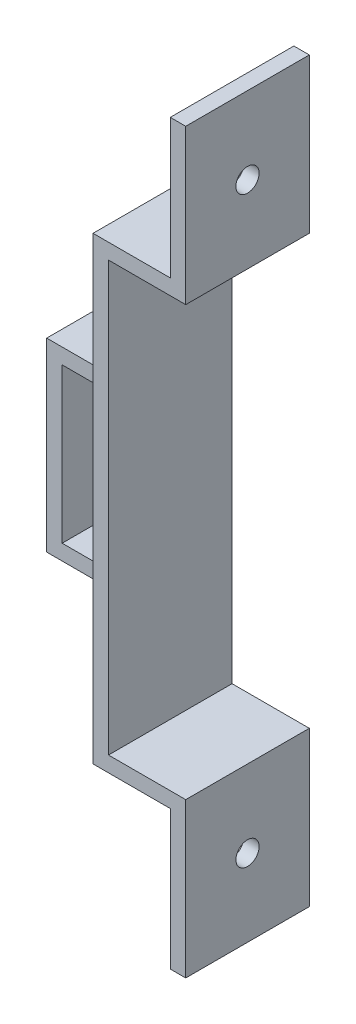
ISO-10303-21;
HEADER;
FILE_DESCRIPTION(('STEP AP214'),'2;1');
FILE_NAME('part.step','',(''),(''),'','','');
FILE_SCHEMA(('AUTOMOTIVE_DESIGN { 1 0 10303 214 1 1 1 1 }'));
ENDSEC;
DATA;
#1=APPLICATION_CONTEXT('core data for automotive mechanical design processes');
#2=APPLICATION_PROTOCOL_DEFINITION('international standard','automotive_design',2000,#1);
#3=PRODUCT_CONTEXT('',#1,'mechanical');
#4=PRODUCT('Part','Part','',(#3));
#5=PRODUCT_RELATED_PRODUCT_CATEGORY('part','',(#4));
#6=PRODUCT_DEFINITION_FORMATION('','',#4);
#7=PRODUCT_DEFINITION_CONTEXT('part definition',#1,'design');
#8=PRODUCT_DEFINITION('design','',#6,#7);
#9=PRODUCT_DEFINITION_SHAPE('','',#8);
#10=(LENGTH_UNIT() NAMED_UNIT(*) SI_UNIT(.MILLI.,.METRE.));
#11=(NAMED_UNIT(*) PLANE_ANGLE_UNIT() SI_UNIT($,.RADIAN.));
#12=(NAMED_UNIT(*) SI_UNIT($,.STERADIAN.) SOLID_ANGLE_UNIT());
#13=UNCERTAINTY_MEASURE_WITH_UNIT(LENGTH_MEASURE(1.E-05),#10,'distance_accuracy_value','');
#14=(GEOMETRIC_REPRESENTATION_CONTEXT(3) GLOBAL_UNCERTAINTY_ASSIGNED_CONTEXT((#13)) GLOBAL_UNIT_ASSIGNED_CONTEXT((#10,
#11,#12)) REPRESENTATION_CONTEXT('',''));
#15=CARTESIAN_POINT('',(0.,0.,0.));
#16=DIRECTION('',(0.,0.,1.));
#17=DIRECTION('',(1.,0.,0.));
#18=AXIS2_PLACEMENT_3D('',#15,#16,#17);
#19=CARTESIAN_POINT('',(-25.,0.,8.));
#20=DIRECTION('',(1.,0.,0.));
#21=DIRECTION('',(0.,1.,0.));
#22=AXIS2_PLACEMENT_3D('',#19,#20,#21);
#23=PLANE('',#22);
#24=DIRECTION('',(0.,1.,0.));
#25=VECTOR('',#24,1.);
#26=CARTESIAN_POINT('',(-25.,12.,5.));
#27=LINE('',#26,#25);
#28=CARTESIAN_POINT('',(-25.,10.,5.));
#29=VERTEX_POINT('',#28);
#30=CARTESIAN_POINT('',(-25.,12.,5.));
#31=VERTEX_POINT('',#30);
#32=EDGE_CURVE('E179',#29,#31,#27,.T.);
#33=ORIENTED_EDGE('',*,*,#32,.F.);
#34=DIRECTION('',(0.,0.,-1.));
#35=VECTOR('',#34,1.);
#36=CARTESIAN_POINT('',(-25.,10.,5.));
#37=LINE('',#36,#35);
#38=CARTESIAN_POINT('',(-25.,10.,-5.));
#39=VERTEX_POINT('',#38);
#40=EDGE_CURVE('E578',#29,#39,#37,.T.);
#41=ORIENTED_EDGE('',*,*,#40,.T.);
#42=DIRECTION('',(0.,1.,0.));
#43=VECTOR('',#42,1.);
#44=CARTESIAN_POINT('',(-25.,12.,-5.));
#45=LINE('',#44,#43);
#46=CARTESIAN_POINT('',(-25.,12.,-5.));
#47=VERTEX_POINT('',#46);
#48=EDGE_CURVE('E193',#39,#47,#45,.T.);
#49=ORIENTED_EDGE('',*,*,#48,.T.);
#50=DIRECTION('',(0.,0.,-1.));
#51=VECTOR('',#50,1.);
#52=CARTESIAN_POINT('',(-25.,12.,5.));
#53=LINE('',#52,#51);
#54=EDGE_CURVE('E58',#31,#47,#53,.T.);
#55=ORIENTED_EDGE('',*,*,#54,.F.);
#56=EDGE_LOOP('',(#33,#41,#49,#55));
#57=FACE_BOUND('',#56,.T.);
#58=DIRECTION('',(0.,-1.,0.));
#59=VECTOR('',#58,1.);
#60=CARTESIAN_POINT('',(-25.,0.,-8.));
#61=LINE('',#60,#59);
#62=CARTESIAN_POINT('',(-25.,29.75,-8.));
#63=VERTEX_POINT('',#62);
#64=CARTESIAN_POINT('',(-25.,-29.75,-8.));
#65=VERTEX_POINT('',#64);
#66=EDGE_CURVE('E270',#63,#65,#61,.T.);
#67=ORIENTED_EDGE('',*,*,#66,.T.);
#68=DIRECTION('',(0.,0.,-1.));
#69=VECTOR('',#68,1.);
#70=CARTESIAN_POINT('',(-25.,-29.75,8.));
#71=LINE('',#70,#69);
#72=CARTESIAN_POINT('',(-25.,-29.75,8.));
#73=VERTEX_POINT('',#72);
#74=EDGE_CURVE('E280',#73,#65,#71,.T.);
#75=ORIENTED_EDGE('',*,*,#74,.F.);
#76=DIRECTION('',(0.,-1.,0.));
#77=VECTOR('',#76,1.);
#78=CARTESIAN_POINT('',(-25.,0.,8.));
#79=LINE('',#78,#77);
#80=CARTESIAN_POINT('',(-25.,29.75,8.));
#81=VERTEX_POINT('',#80);
#82=EDGE_CURVE('E237',#81,#73,#79,.T.);
#83=ORIENTED_EDGE('',*,*,#82,.F.);
#84=DIRECTION('',(0.,0.,-1.));
#85=VECTOR('',#84,1.);
#86=CARTESIAN_POINT('',(-25.,29.75,8.));
#87=LINE('',#86,#85);
#88=EDGE_CURVE('E283',#81,#63,#87,.T.);
#89=ORIENTED_EDGE('',*,*,#88,.T.);
#90=EDGE_LOOP('',(#67,#75,#83,#89));
#91=FACE_BOUND('',#90,.T.);
#92=DIRECTION('',(0.,1.,0.));
#93=VECTOR('',#92,1.);
#94=CARTESIAN_POINT('',(-25.,-10.,5.));
#95=LINE('',#94,#93);
#96=CARTESIAN_POINT('',(-25.,-12.,5.));
#97=VERTEX_POINT('',#96);
#98=CARTESIAN_POINT('',(-25.,-10.,5.));
#99=VERTEX_POINT('',#98);
#100=EDGE_CURVE('E616',#97,#99,#95,.T.);
#101=ORIENTED_EDGE('',*,*,#100,.F.);
#102=DIRECTION('',(0.,0.,-1.));
#103=VECTOR('',#102,1.);
#104=CARTESIAN_POINT('',(-25.,-12.,5.));
#105=LINE('',#104,#103);
#106=CARTESIAN_POINT('',(-25.,-12.,-5.));
#107=VERTEX_POINT('',#106);
#108=EDGE_CURVE('E593',#97,#107,#105,.T.);
#109=ORIENTED_EDGE('',*,*,#108,.T.);
#110=DIRECTION('',(0.,1.,0.));
#111=VECTOR('',#110,1.);
#112=CARTESIAN_POINT('',(-25.,-10.,-5.));
#113=LINE('',#112,#111);
#114=CARTESIAN_POINT('',(-25.,-10.,-5.));
#115=VERTEX_POINT('',#114);
#116=EDGE_CURVE('E604',#107,#115,#113,.T.);
#117=ORIENTED_EDGE('',*,*,#116,.T.);
#118=DIRECTION('',(0.,0.,-1.));
#119=VECTOR('',#118,1.);
#120=CARTESIAN_POINT('',(-25.,-10.,5.));
#121=LINE('',#120,#119);
#122=EDGE_CURVE('E591',#99,#115,#121,.T.);
#123=ORIENTED_EDGE('',*,*,#122,.F.);
#124=EDGE_LOOP('',(#101,#109,#117,#123));
#125=FACE_BOUND('',#124,.T.);
#126=ADVANCED_FACE('F35',(#57,#91,#125),#23,.F.);
#127=CARTESIAN_POINT('',(0.,-47.75,8.));
#128=DIRECTION('',(0.,1.,0.));
#129=DIRECTION('',(0.,0.,1.));
#130=AXIS2_PLACEMENT_3D('',#127,#128,#129);
#131=PLANE('',#130);
#132=DIRECTION('',(1.,0.,0.));
#133=VECTOR('',#132,1.);
#134=CARTESIAN_POINT('',(0.,-47.75,-8.));
#135=LINE('',#134,#133);
#136=CARTESIAN_POINT('',(-15.,-47.75,-8.));
#137=VERTEX_POINT('',#136);
#138=CARTESIAN_POINT('',(-13.,-47.75,-8.));
#139=VERTEX_POINT('',#138);
#140=EDGE_CURVE('E211',#137,#139,#135,.T.);
#141=ORIENTED_EDGE('',*,*,#140,.T.);
#142=DIRECTION('',(0.,0.,-1.));
#143=VECTOR('',#142,1.);
#144=CARTESIAN_POINT('',(-13.,-47.75,8.));
#145=LINE('',#144,#143);
#146=CARTESIAN_POINT('',(-13.,-47.75,8.));
#147=VERTEX_POINT('',#146);
#148=EDGE_CURVE('E11',#147,#139,#145,.T.);
#149=ORIENTED_EDGE('',*,*,#148,.F.);
#150=DIRECTION('',(1.,0.,0.));
#151=VECTOR('',#150,1.);
#152=CARTESIAN_POINT('',(0.,-47.75,8.));
#153=LINE('',#152,#151);
#154=CARTESIAN_POINT('',(-15.,-47.75,8.));
#155=VERTEX_POINT('',#154);
#156=EDGE_CURVE('E212',#155,#147,#153,.T.);
#157=ORIENTED_EDGE('',*,*,#156,.F.);
#158=DIRECTION('',(0.,0.,-1.));
#159=VECTOR('',#158,1.);
#160=CARTESIAN_POINT('',(-15.,-47.75,8.));
#161=LINE('',#160,#159);
#162=EDGE_CURVE('E244',#155,#137,#161,.T.);
#163=ORIENTED_EDGE('',*,*,#162,.T.);
#164=EDGE_LOOP('',(#141,#149,#157,#163));
#165=FACE_BOUND('',#164,.T.);
#166=ADVANCED_FACE('F37',(#165),#131,.F.);
#167=CARTESIAN_POINT('',(-13.,0.,8.));
#168=DIRECTION('',(-1.,0.,0.));
#169=DIRECTION('',(0.,0.,1.));
#170=AXIS2_PLACEMENT_3D('',#167,#168,#169);
#171=PLANE('',#170);
#172=CARTESIAN_POINT('',(-13.,-37.75,0.));
#173=DIRECTION('',(-1.,0.,0.));
#174=DIRECTION('',(0.,0.,1.));
#175=AXIS2_PLACEMENT_3D('',#172,#173,#174);
#176=CIRCLE('',#175,1.5);
#177=CARTESIAN_POINT('',(-13.,-37.75,1.5));
#178=VERTEX_POINT('',#177);
#179=EDGE_CURVE('E204',#178,#178,#176,.T.);
#180=ORIENTED_EDGE('',*,*,#179,.T.);
#181=EDGE_LOOP('',(#180));
#182=FACE_BOUND('',#181,.T.);
#183=DIRECTION('',(0.,1.,0.));
#184=VECTOR('',#183,1.);
#185=CARTESIAN_POINT('',(-13.,0.,-8.));
#186=LINE('',#185,#184);
#187=CARTESIAN_POINT('',(-13.,-27.75,-8.));
#188=VERTEX_POINT('',#187);
#189=EDGE_CURVE('E247',#139,#188,#186,.T.);
#190=ORIENTED_EDGE('',*,*,#189,.T.);
#191=DIRECTION('',(0.,0.,-1.));
#192=VECTOR('',#191,1.);
#193=CARTESIAN_POINT('',(-13.,-27.75,8.));
#194=LINE('',#193,#192);
#195=CARTESIAN_POINT('',(-13.,-27.75,8.));
#196=VERTEX_POINT('',#195);
#197=EDGE_CURVE('E43',#196,#188,#194,.T.);
#198=ORIENTED_EDGE('',*,*,#197,.F.);
#199=DIRECTION('',(0.,1.,0.));
#200=VECTOR('',#199,1.);
#201=CARTESIAN_POINT('',(-13.,0.,8.));
#202=LINE('',#201,#200);
#203=EDGE_CURVE('E215',#147,#196,#202,.T.);
#204=ORIENTED_EDGE('',*,*,#203,.F.);
#205=ORIENTED_EDGE('',*,*,#148,.T.);
#206=EDGE_LOOP('',(#190,#198,#204,#205));
#207=FACE_BOUND('',#206,.T.);
#208=ADVANCED_FACE('F303',(#182,#207),#171,.F.);
#209=CARTESIAN_POINT('',(0.,-27.75,8.));
#210=DIRECTION('',(0.,1.,0.));
#211=DIRECTION('',(0.,0.,1.));
#212=AXIS2_PLACEMENT_3D('',#209,#210,#211);
#213=PLANE('',#212);
#214=DIRECTION('',(1.,0.,0.));
#215=VECTOR('',#214,1.);
#216=CARTESIAN_POINT('',(0.,-27.75,-8.));
#217=LINE('',#216,#215);
#218=CARTESIAN_POINT('',(-23.,-27.75,-8.));
#219=VERTEX_POINT('',#218);
#220=EDGE_CURVE('E250',#219,#188,#217,.T.);
#221=ORIENTED_EDGE('',*,*,#220,.F.);
#222=DIRECTION('',(0.,0.,-1.));
#223=VECTOR('',#222,1.);
#224=CARTESIAN_POINT('',(-23.,-27.75,8.));
#225=LINE('',#224,#223);
#226=CARTESIAN_POINT('',(-23.,-27.75,8.));
#227=VERTEX_POINT('',#226);
#228=EDGE_CURVE('E296',#227,#219,#225,.T.);
#229=ORIENTED_EDGE('',*,*,#228,.F.);
#230=DIRECTION('',(1.,0.,0.));
#231=VECTOR('',#230,1.);
#232=CARTESIAN_POINT('',(0.,-27.75,8.));
#233=LINE('',#232,#231);
#234=EDGE_CURVE('E218',#227,#196,#233,.T.);
#235=ORIENTED_EDGE('',*,*,#234,.T.);
#236=ORIENTED_EDGE('',*,*,#197,.T.);
#237=EDGE_LOOP('',(#221,#229,#235,#236));
#238=FACE_BOUND('',#237,.T.);
#239=ADVANCED_FACE('F300',(#238),#213,.T.);
#240=CARTESIAN_POINT('',(-23.,0.,8.));
#241=DIRECTION('',(1.,0.,0.));
#242=DIRECTION('',(0.,1.,0.));
#243=AXIS2_PLACEMENT_3D('',#240,#241,#242);
#244=PLANE('',#243);
#245=DIRECTION('',(0.,-1.,0.));
#246=VECTOR('',#245,1.);
#247=CARTESIAN_POINT('',(-23.,0.,-8.));
#248=LINE('',#247,#246);
#249=CARTESIAN_POINT('',(-23.,27.75,-8.));
#250=VERTEX_POINT('',#249);
#251=EDGE_CURVE('E253',#250,#219,#248,.T.);
#252=ORIENTED_EDGE('',*,*,#251,.F.);
#253=DIRECTION('',(0.,0.,-1.));
#254=VECTOR('',#253,1.);
#255=CARTESIAN_POINT('',(-23.,27.75,8.));
#256=LINE('',#255,#254);
#257=CARTESIAN_POINT('',(-23.,27.75,8.));
#258=VERTEX_POINT('',#257);
#259=EDGE_CURVE('E294',#258,#250,#256,.T.);
#260=ORIENTED_EDGE('',*,*,#259,.F.);
#261=DIRECTION('',(0.,-1.,0.));
#262=VECTOR('',#261,1.);
#263=CARTESIAN_POINT('',(-23.,0.,8.));
#264=LINE('',#263,#262);
#265=EDGE_CURVE('E221',#258,#227,#264,.T.);
#266=ORIENTED_EDGE('',*,*,#265,.T.);
#267=ORIENTED_EDGE('',*,*,#228,.T.);
#268=EDGE_LOOP('',(#252,#260,#266,#267));
#269=FACE_BOUND('',#268,.T.);
#270=ADVANCED_FACE('F312',(#269),#244,.T.);
#271=CARTESIAN_POINT('',(0.,27.75,8.));
#272=DIRECTION('',(0.,-1.,0.));
#273=DIRECTION('',(1.,0.,0.));
#274=AXIS2_PLACEMENT_3D('',#271,#272,#273);
#275=PLANE('',#274);
#276=DIRECTION('',(-1.,0.,0.));
#277=VECTOR('',#276,1.);
#278=CARTESIAN_POINT('',(0.,27.75,-8.));
#279=LINE('',#278,#277);
#280=CARTESIAN_POINT('',(-13.,27.75,-8.));
#281=VERTEX_POINT('',#280);
#282=EDGE_CURVE('E256',#281,#250,#279,.T.);
#283=ORIENTED_EDGE('',*,*,#282,.F.);
#284=DIRECTION('',(0.,0.,-1.));
#285=VECTOR('',#284,1.);
#286=CARTESIAN_POINT('',(-13.,27.75,8.));
#287=LINE('',#286,#285);
#288=CARTESIAN_POINT('',(-13.,27.75,8.));
#289=VERTEX_POINT('',#288);
#290=EDGE_CURVE('E292',#289,#281,#287,.T.);
#291=ORIENTED_EDGE('',*,*,#290,.F.);
#292=DIRECTION('',(-1.,0.,0.));
#293=VECTOR('',#292,1.);
#294=CARTESIAN_POINT('',(0.,27.75,8.));
#295=LINE('',#294,#293);
#296=EDGE_CURVE('E224',#289,#258,#295,.T.);
#297=ORIENTED_EDGE('',*,*,#296,.T.);
#298=ORIENTED_EDGE('',*,*,#259,.T.);
#299=EDGE_LOOP('',(#283,#291,#297,#298));
#300=FACE_BOUND('',#299,.T.);
#301=ADVANCED_FACE('F350',(#300),#275,.T.);
#302=CARTESIAN_POINT('',(-13.,0.,8.));
#303=DIRECTION('',(-1.,0.,0.));
#304=DIRECTION('',(0.,-1.,0.));
#305=AXIS2_PLACEMENT_3D('',#302,#303,#304);
#306=PLANE('',#305);
#307=CARTESIAN_POINT('',(-13.,37.75,0.));
#308=DIRECTION('',(-1.,0.,0.));
#309=DIRECTION('',(0.,-1.,0.));
#310=AXIS2_PLACEMENT_3D('',#307,#308,#309);
#311=CIRCLE('',#310,1.5);
#312=CARTESIAN_POINT('',(-13.,36.25,0.));
#313=VERTEX_POINT('',#312);
#314=EDGE_CURVE('E208',#313,#313,#311,.T.);
#315=ORIENTED_EDGE('',*,*,#314,.T.);
#316=EDGE_LOOP('',(#315));
#317=FACE_BOUND('',#316,.T.);
#318=DIRECTION('',(0.,1.,0.));
#319=VECTOR('',#318,1.);
#320=CARTESIAN_POINT('',(-13.,0.,-8.));
#321=LINE('',#320,#319);
#322=CARTESIAN_POINT('',(-13.,47.75,-8.));
#323=VERTEX_POINT('',#322);
#324=EDGE_CURVE('E259',#281,#323,#321,.T.);
#325=ORIENTED_EDGE('',*,*,#324,.T.);
#326=DIRECTION('',(0.,0.,-1.));
#327=VECTOR('',#326,1.);
#328=CARTESIAN_POINT('',(-13.,47.75,8.));
#329=LINE('',#328,#327);
#330=CARTESIAN_POINT('',(-13.,47.75,8.));
#331=VERTEX_POINT('',#330);
#332=EDGE_CURVE('E290',#331,#323,#329,.T.);
#333=ORIENTED_EDGE('',*,*,#332,.F.);
#334=DIRECTION('',(0.,1.,0.));
#335=VECTOR('',#334,1.);
#336=CARTESIAN_POINT('',(-13.,0.,8.));
#337=LINE('',#336,#335);
#338=EDGE_CURVE('E227',#289,#331,#337,.T.);
#339=ORIENTED_EDGE('',*,*,#338,.F.);
#340=ORIENTED_EDGE('',*,*,#290,.T.);
#341=EDGE_LOOP('',(#325,#333,#339,#340));
#342=FACE_BOUND('',#341,.T.);
#343=ADVANCED_FACE('F348',(#317,#342),#306,.F.);
#344=CARTESIAN_POINT('',(0.,47.75,8.));
#345=DIRECTION('',(0.,1.,0.));
#346=DIRECTION('',(0.,0.,1.));
#347=AXIS2_PLACEMENT_3D('',#344,#345,#346);
#348=PLANE('',#347);
#349=DIRECTION('',(1.,0.,0.));
#350=VECTOR('',#349,1.);
#351=CARTESIAN_POINT('',(0.,47.75,-8.));
#352=LINE('',#351,#350);
#353=CARTESIAN_POINT('',(-15.,47.75,-8.));
#354=VERTEX_POINT('',#353);
#355=EDGE_CURVE('E262',#354,#323,#352,.T.);
#356=ORIENTED_EDGE('',*,*,#355,.F.);
#357=DIRECTION('',(0.,0.,-1.));
#358=VECTOR('',#357,1.);
#359=CARTESIAN_POINT('',(-15.,47.75,8.));
#360=LINE('',#359,#358);
#361=CARTESIAN_POINT('',(-15.,47.75,8.));
#362=VERTEX_POINT('',#361);
#363=EDGE_CURVE('E288',#362,#354,#360,.T.);
#364=ORIENTED_EDGE('',*,*,#363,.F.);
#365=DIRECTION('',(1.,0.,0.));
#366=VECTOR('',#365,1.);
#367=CARTESIAN_POINT('',(0.,47.75,8.));
#368=LINE('',#367,#366);
#369=EDGE_CURVE('E229',#362,#331,#368,.T.);
#370=ORIENTED_EDGE('',*,*,#369,.T.);
#371=ORIENTED_EDGE('',*,*,#332,.T.);
#372=EDGE_LOOP('',(#356,#364,#370,#371));
#373=FACE_BOUND('',#372,.T.);
#374=ADVANCED_FACE('F343',(#373),#348,.T.);
#375=CARTESIAN_POINT('',(-15.,0.,8.));
#376=DIRECTION('',(-1.,0.,0.));
#377=DIRECTION('',(0.,0.,1.));
#378=AXIS2_PLACEMENT_3D('',#375,#376,#377);
#379=PLANE('',#378);
#380=CARTESIAN_POINT('',(-15.,37.75,0.));
#381=DIRECTION('',(-1.,0.,0.));
#382=DIRECTION('',(0.,0.,1.));
#383=AXIS2_PLACEMENT_3D('',#380,#381,#382);
#384=CIRCLE('',#383,1.5);
#385=CARTESIAN_POINT('',(-15.,37.75,1.5));
#386=VERTEX_POINT('',#385);
#387=EDGE_CURVE('E197',#386,#386,#384,.T.);
#388=ORIENTED_EDGE('',*,*,#387,.F.);
#389=EDGE_LOOP('',(#388));
#390=FACE_BOUND('',#389,.T.);
#391=DIRECTION('',(0.,1.,0.));
#392=VECTOR('',#391,1.);
#393=CARTESIAN_POINT('',(-15.,0.,-8.));
#394=LINE('',#393,#392);
#395=CARTESIAN_POINT('',(-15.,29.75,-8.));
#396=VERTEX_POINT('',#395);
#397=EDGE_CURVE('E265',#396,#354,#394,.T.);
#398=ORIENTED_EDGE('',*,*,#397,.F.);
#399=DIRECTION('',(0.,0.,-1.));
#400=VECTOR('',#399,1.);
#401=CARTESIAN_POINT('',(-15.,29.75,8.));
#402=LINE('',#401,#400);
#403=CARTESIAN_POINT('',(-15.,29.75,8.));
#404=VERTEX_POINT('',#403);
#405=EDGE_CURVE('E286',#404,#396,#402,.T.);
#406=ORIENTED_EDGE('',*,*,#405,.F.);
#407=DIRECTION('',(0.,1.,0.));
#408=VECTOR('',#407,1.);
#409=CARTESIAN_POINT('',(-15.,0.,8.));
#410=LINE('',#409,#408);
#411=EDGE_CURVE('E232',#404,#362,#410,.T.);
#412=ORIENTED_EDGE('',*,*,#411,.T.);
#413=ORIENTED_EDGE('',*,*,#363,.T.);
#414=EDGE_LOOP('',(#398,#406,#412,#413));
#415=FACE_BOUND('',#414,.T.);
#416=ADVANCED_FACE('F340',(#390,#415),#379,.T.);
#417=CARTESIAN_POINT('',(0.,29.75,8.));
#418=DIRECTION('',(0.,-1.,0.));
#419=DIRECTION('',(1.,0.,0.));
#420=AXIS2_PLACEMENT_3D('',#417,#418,#419);
#421=PLANE('',#420);
#422=DIRECTION('',(-1.,0.,0.));
#423=VECTOR('',#422,1.);
#424=CARTESIAN_POINT('',(0.,29.75,-8.));
#425=LINE('',#424,#423);
#426=EDGE_CURVE('E268',#396,#63,#425,.T.);
#427=ORIENTED_EDGE('',*,*,#426,.T.);
#428=ORIENTED_EDGE('',*,*,#88,.F.);
#429=DIRECTION('',(-1.,0.,0.));
#430=VECTOR('',#429,1.);
#431=CARTESIAN_POINT('',(0.,29.75,8.));
#432=LINE('',#431,#430);
#433=EDGE_CURVE('E235',#404,#81,#432,.T.);
#434=ORIENTED_EDGE('',*,*,#433,.F.);
#435=ORIENTED_EDGE('',*,*,#405,.T.);
#436=EDGE_LOOP('',(#427,#428,#434,#435));
#437=FACE_BOUND('',#436,.T.);
#438=ADVANCED_FACE('F337',(#437),#421,.F.);
#439=CARTESIAN_POINT('',(0.,-29.75,8.));
#440=DIRECTION('',(0.,1.,0.));
#441=DIRECTION('',(0.,0.,1.));
#442=AXIS2_PLACEMENT_3D('',#439,#440,#441);
#443=PLANE('',#442);
#444=DIRECTION('',(1.,0.,0.));
#445=VECTOR('',#444,1.);
#446=CARTESIAN_POINT('',(0.,-29.75,-8.));
#447=LINE('',#446,#445);
#448=CARTESIAN_POINT('',(-15.,-29.75,-8.));
#449=VERTEX_POINT('',#448);
#450=EDGE_CURVE('E272',#65,#449,#447,.T.);
#451=ORIENTED_EDGE('',*,*,#450,.T.);
#452=DIRECTION('',(0.,0.,-1.));
#453=VECTOR('',#452,1.);
#454=CARTESIAN_POINT('',(-15.,-29.75,8.));
#455=LINE('',#454,#453);
#456=CARTESIAN_POINT('',(-15.,-29.75,8.));
#457=VERTEX_POINT('',#456);
#458=EDGE_CURVE('E278',#457,#449,#455,.T.);
#459=ORIENTED_EDGE('',*,*,#458,.F.);
#460=DIRECTION('',(1.,0.,0.));
#461=VECTOR('',#460,1.);
#462=CARTESIAN_POINT('',(0.,-29.75,8.));
#463=LINE('',#462,#461);
#464=EDGE_CURVE('E239',#73,#457,#463,.T.);
#465=ORIENTED_EDGE('',*,*,#464,.F.);
#466=ORIENTED_EDGE('',*,*,#74,.T.);
#467=EDGE_LOOP('',(#451,#459,#465,#466));
#468=FACE_BOUND('',#467,.T.);
#469=ADVANCED_FACE('F327',(#468),#443,.F.);
#470=CARTESIAN_POINT('',(-15.,0.,8.));
#471=DIRECTION('',(-1.,0.,0.));
#472=DIRECTION('',(0.,0.,1.));
#473=AXIS2_PLACEMENT_3D('',#470,#471,#472);
#474=PLANE('',#473);
#475=CARTESIAN_POINT('',(-15.,-37.75,0.));
#476=DIRECTION('',(-1.,0.,0.));
#477=DIRECTION('',(0.,0.,1.));
#478=AXIS2_PLACEMENT_3D('',#475,#476,#477);
#479=CIRCLE('',#478,1.5);
#480=CARTESIAN_POINT('',(-15.,-37.75,1.5));
#481=VERTEX_POINT('',#480);
#482=EDGE_CURVE('E194',#481,#481,#479,.T.);
#483=ORIENTED_EDGE('',*,*,#482,.F.);
#484=EDGE_LOOP('',(#483));
#485=FACE_BOUND('',#484,.T.);
#486=DIRECTION('',(0.,1.,0.));
#487=VECTOR('',#486,1.);
#488=CARTESIAN_POINT('',(-15.,0.,-8.));
#489=LINE('',#488,#487);
#490=EDGE_CURVE('E216',#137,#449,#489,.T.);
#491=ORIENTED_EDGE('',*,*,#490,.F.);
#492=ORIENTED_EDGE('',*,*,#162,.F.);
#493=DIRECTION('',(0.,1.,0.));
#494=VECTOR('',#493,1.);
#495=CARTESIAN_POINT('',(-15.,0.,8.));
#496=LINE('',#495,#494);
#497=EDGE_CURVE('E241',#155,#457,#496,.T.);
#498=ORIENTED_EDGE('',*,*,#497,.T.);
#499=ORIENTED_EDGE('',*,*,#458,.T.);
#500=EDGE_LOOP('',(#491,#492,#498,#499));
#501=FACE_BOUND('',#500,.T.);
#502=ADVANCED_FACE('F323',(#485,#501),#474,.T.);
#503=CARTESIAN_POINT('',(0.,0.,8.));
#504=DIRECTION('',(0.,0.,1.));
#505=DIRECTION('',(1.,0.,0.));
#506=AXIS2_PLACEMENT_3D('',#503,#504,#505);
#507=PLANE('',#506);
#508=ORIENTED_EDGE('',*,*,#156,.T.);
#509=ORIENTED_EDGE('',*,*,#203,.T.);
#510=ORIENTED_EDGE('',*,*,#234,.F.);
#511=ORIENTED_EDGE('',*,*,#265,.F.);
#512=ORIENTED_EDGE('',*,*,#296,.F.);
#513=ORIENTED_EDGE('',*,*,#338,.T.);
#514=ORIENTED_EDGE('',*,*,#369,.F.);
#515=ORIENTED_EDGE('',*,*,#411,.F.);
#516=ORIENTED_EDGE('',*,*,#433,.T.);
#517=ORIENTED_EDGE('',*,*,#82,.T.);
#518=ORIENTED_EDGE('',*,*,#464,.T.);
#519=ORIENTED_EDGE('',*,*,#497,.F.);
#520=EDGE_LOOP('',(#508,#509,#510,#511,#512,#513,#514,#515,#516,#517,#518,#519));
#521=FACE_BOUND('',#520,.T.);
#522=ADVANCED_FACE('F315',(#521),#507,.T.);
#523=CARTESIAN_POINT('',(0.,0.,-8.));
#524=DIRECTION('',(0.,0.,1.));
#525=DIRECTION('',(1.,0.,0.));
#526=AXIS2_PLACEMENT_3D('',#523,#524,#525);
#527=PLANE('',#526);
#528=ORIENTED_EDGE('',*,*,#140,.F.);
#529=ORIENTED_EDGE('',*,*,#490,.T.);
#530=ORIENTED_EDGE('',*,*,#450,.F.);
#531=ORIENTED_EDGE('',*,*,#66,.F.);
#532=ORIENTED_EDGE('',*,*,#426,.F.);
#533=ORIENTED_EDGE('',*,*,#397,.T.);
#534=ORIENTED_EDGE('',*,*,#355,.T.);
#535=ORIENTED_EDGE('',*,*,#324,.F.);
#536=ORIENTED_EDGE('',*,*,#282,.T.);
#537=ORIENTED_EDGE('',*,*,#251,.T.);
#538=ORIENTED_EDGE('',*,*,#220,.T.);
#539=ORIENTED_EDGE('',*,*,#189,.F.);
#540=EDGE_LOOP('',(#528,#529,#530,#531,#532,#533,#534,#535,#536,#537,#538,#539));
#541=FACE_BOUND('',#540,.T.);
#542=ADVANCED_FACE('F307',(#541),#527,.F.);
#543=CARTESIAN_POINT('',(-5.,-37.75,0.));
#544=DIRECTION('',(-1.,0.,0.));
#545=DIRECTION('',(0.,0.,1.));
#546=AXIS2_PLACEMENT_3D('',#543,#544,#545);
#547=CYLINDRICAL_SURFACE('',#546,1.5);
#548=ORIENTED_EDGE('',*,*,#482,.T.);
#549=EDGE_LOOP('',(#548));
#550=FACE_BOUND('',#549,.T.);
#551=ORIENTED_EDGE('',*,*,#179,.F.);
#552=EDGE_LOOP('',(#551));
#553=FACE_BOUND('',#552,.T.);
#554=ADVANCED_FACE('F410',(#550,#553),#547,.F.);
#555=CARTESIAN_POINT('',(-5.,37.75,0.));
#556=DIRECTION('',(-1.,0.,0.));
#557=DIRECTION('',(0.,0.,1.));
#558=AXIS2_PLACEMENT_3D('',#555,#556,#557);
#559=CYLINDRICAL_SURFACE('',#558,1.5);
#560=ORIENTED_EDGE('',*,*,#387,.T.);
#561=EDGE_LOOP('',(#560));
#562=FACE_BOUND('',#561,.T.);
#563=ORIENTED_EDGE('',*,*,#314,.F.);
#564=EDGE_LOOP('',(#563));
#565=FACE_BOUND('',#564,.T.);
#566=ADVANCED_FACE('F417',(#562,#565),#559,.F.);
#567=CARTESIAN_POINT('',(-25.,12.,5.));
#568=DIRECTION('',(0.,-1.,0.));
#569=DIRECTION('',(0.,0.,-1.));
#570=AXIS2_PLACEMENT_3D('',#567,#568,#569);
#571=PLANE('',#570);
#572=DIRECTION('',(-1.,0.,0.));
#573=VECTOR('',#572,1.);
#574=CARTESIAN_POINT('',(-25.,12.,-5.));
#575=LINE('',#574,#573);
#576=CARTESIAN_POINT('',(-34.,12.,-5.));
#577=VERTEX_POINT('',#576);
#578=EDGE_CURVE('E576',#47,#577,#575,.T.);
#579=ORIENTED_EDGE('',*,*,#578,.T.);
#580=DIRECTION('',(0.,0.,-1.));
#581=VECTOR('',#580,1.);
#582=CARTESIAN_POINT('',(-34.,12.,5.));
#583=LINE('',#582,#581);
#584=CARTESIAN_POINT('',(-34.,12.,5.));
#585=VERTEX_POINT('',#584);
#586=EDGE_CURVE('E175',#585,#577,#583,.T.);
#587=ORIENTED_EDGE('',*,*,#586,.F.);
#588=DIRECTION('',(-1.,0.,0.));
#589=VECTOR('',#588,1.);
#590=CARTESIAN_POINT('',(-25.,12.,5.));
#591=LINE('',#590,#589);
#592=EDGE_CURVE('E171',#31,#585,#591,.T.);
#593=ORIENTED_EDGE('',*,*,#592,.F.);
#594=ORIENTED_EDGE('',*,*,#54,.T.);
#595=EDGE_LOOP('',(#579,#587,#593,#594));
#596=FACE_BOUND('',#595,.T.);
#597=ADVANCED_FACE('F173',(#596),#571,.F.);
#598=CARTESIAN_POINT('',(-34.,12.,5.));
#599=DIRECTION('',(1.,0.,0.));
#600=DIRECTION('',(0.,0.,-1.));
#601=AXIS2_PLACEMENT_3D('',#598,#599,#600);
#602=PLANE('',#601);
#603=DIRECTION('',(0.,-1.,0.));
#604=VECTOR('',#603,1.);
#605=CARTESIAN_POINT('',(-34.,12.,-5.));
#606=LINE('',#605,#604);
#607=CARTESIAN_POINT('',(-34.,-12.,-5.));
#608=VERTEX_POINT('',#607);
#609=EDGE_CURVE('E602',#577,#608,#606,.T.);
#610=ORIENTED_EDGE('',*,*,#609,.T.);
#611=DIRECTION('',(0.,0.,-1.));
#612=VECTOR('',#611,1.);
#613=CARTESIAN_POINT('',(-34.,-12.,5.));
#614=LINE('',#613,#612);
#615=CARTESIAN_POINT('',(-34.,-12.,5.));
#616=VERTEX_POINT('',#615);
#617=EDGE_CURVE('E199',#616,#608,#614,.T.);
#618=ORIENTED_EDGE('',*,*,#617,.F.);
#619=DIRECTION('',(0.,-1.,0.));
#620=VECTOR('',#619,1.);
#621=CARTESIAN_POINT('',(-34.,12.,5.));
#622=LINE('',#621,#620);
#623=EDGE_CURVE('E178',#585,#616,#622,.T.);
#624=ORIENTED_EDGE('',*,*,#623,.F.);
#625=ORIENTED_EDGE('',*,*,#586,.T.);
#626=EDGE_LOOP('',(#610,#618,#624,#625));
#627=FACE_BOUND('',#626,.T.);
#628=ADVANCED_FACE('F432',(#627),#602,.F.);
#629=CARTESIAN_POINT('',(-34.,-12.,5.));
#630=DIRECTION('',(0.,1.,0.));
#631=DIRECTION('',(0.,0.,1.));
#632=AXIS2_PLACEMENT_3D('',#629,#630,#631);
#633=PLANE('',#632);
#634=DIRECTION('',(1.,0.,0.));
#635=VECTOR('',#634,1.);
#636=CARTESIAN_POINT('',(-34.,-12.,-5.));
#637=LINE('',#636,#635);
#638=EDGE_CURVE('E600',#608,#107,#637,.T.);
#639=ORIENTED_EDGE('',*,*,#638,.T.);
#640=ORIENTED_EDGE('',*,*,#108,.F.);
#641=DIRECTION('',(1.,0.,0.));
#642=VECTOR('',#641,1.);
#643=CARTESIAN_POINT('',(-34.,-12.,5.));
#644=LINE('',#643,#642);
#645=EDGE_CURVE('E601',#616,#97,#644,.T.);
#646=ORIENTED_EDGE('',*,*,#645,.F.);
#647=ORIENTED_EDGE('',*,*,#617,.T.);
#648=EDGE_LOOP('',(#639,#640,#646,#647));
#649=FACE_BOUND('',#648,.T.);
#650=ADVANCED_FACE('F439',(#649),#633,.F.);
#651=CARTESIAN_POINT('',(-32.,-10.,5.));
#652=DIRECTION('',(0.,-1.,0.));
#653=DIRECTION('',(1.,0.,0.));
#654=AXIS2_PLACEMENT_3D('',#651,#652,#653);
#655=PLANE('',#654);
#656=DIRECTION('',(-1.,0.,0.));
#657=VECTOR('',#656,1.);
#658=CARTESIAN_POINT('',(-32.,-10.,-5.));
#659=LINE('',#658,#657);
#660=CARTESIAN_POINT('',(-32.,-10.,-5.));
#661=VERTEX_POINT('',#660);
#662=EDGE_CURVE('E50',#115,#661,#659,.T.);
#663=ORIENTED_EDGE('',*,*,#662,.T.);
#664=DIRECTION('',(0.,0.,-1.));
#665=VECTOR('',#664,1.);
#666=CARTESIAN_POINT('',(-32.,-10.,5.));
#667=LINE('',#666,#665);
#668=CARTESIAN_POINT('',(-32.,-10.,5.));
#669=VERTEX_POINT('',#668);
#670=EDGE_CURVE('E582',#669,#661,#667,.T.);
#671=ORIENTED_EDGE('',*,*,#670,.F.);
#672=DIRECTION('',(-1.,0.,0.));
#673=VECTOR('',#672,1.);
#674=CARTESIAN_POINT('',(-32.,-10.,5.));
#675=LINE('',#674,#673);
#676=EDGE_CURVE('E614',#99,#669,#675,.T.);
#677=ORIENTED_EDGE('',*,*,#676,.F.);
#678=ORIENTED_EDGE('',*,*,#122,.T.);
#679=EDGE_LOOP('',(#663,#671,#677,#678));
#680=FACE_BOUND('',#679,.T.);
#681=ADVANCED_FACE('F447',(#680),#655,.F.);
#682=CARTESIAN_POINT('',(-32.,10.,5.));
#683=DIRECTION('',(-1.,0.,0.));
#684=DIRECTION('',(0.,0.,1.));
#685=AXIS2_PLACEMENT_3D('',#682,#683,#684);
#686=PLANE('',#685);
#687=DIRECTION('',(0.,1.,0.));
#688=VECTOR('',#687,1.);
#689=CARTESIAN_POINT('',(-32.,10.,-5.));
#690=LINE('',#689,#688);
#691=CARTESIAN_POINT('',(-32.,10.,-5.));
#692=VERTEX_POINT('',#691);
#693=EDGE_CURVE('E610',#661,#692,#690,.T.);
#694=ORIENTED_EDGE('',*,*,#693,.T.);
#695=DIRECTION('',(0.,0.,-1.));
#696=VECTOR('',#695,1.);
#697=CARTESIAN_POINT('',(-32.,10.,5.));
#698=LINE('',#697,#696);
#699=CARTESIAN_POINT('',(-32.,10.,5.));
#700=VERTEX_POINT('',#699);
#701=EDGE_CURVE('E579',#700,#692,#698,.T.);
#702=ORIENTED_EDGE('',*,*,#701,.F.);
#703=DIRECTION('',(0.,1.,0.));
#704=VECTOR('',#703,1.);
#705=CARTESIAN_POINT('',(-32.,10.,5.));
#706=LINE('',#705,#704);
#707=EDGE_CURVE('E584',#669,#700,#706,.T.);
#708=ORIENTED_EDGE('',*,*,#707,.F.);
#709=ORIENTED_EDGE('',*,*,#670,.T.);
#710=EDGE_LOOP('',(#694,#702,#708,#709));
#711=FACE_BOUND('',#710,.T.);
#712=ADVANCED_FACE('F455',(#711),#686,.F.);
#713=CARTESIAN_POINT('',(-25.,10.,5.));
#714=DIRECTION('',(0.,1.,0.));
#715=DIRECTION('',(-1.,0.,0.));
#716=AXIS2_PLACEMENT_3D('',#713,#714,#715);
#717=PLANE('',#716);
#718=DIRECTION('',(1.,0.,0.));
#719=VECTOR('',#718,1.);
#720=CARTESIAN_POINT('',(-25.,10.,-5.));
#721=LINE('',#720,#719);
#722=EDGE_CURVE('E188',#692,#39,#721,.T.);
#723=ORIENTED_EDGE('',*,*,#722,.T.);
#724=ORIENTED_EDGE('',*,*,#40,.F.);
#725=DIRECTION('',(1.,0.,0.));
#726=VECTOR('',#725,1.);
#727=CARTESIAN_POINT('',(-25.,10.,5.));
#728=LINE('',#727,#726);
#729=EDGE_CURVE('E184',#700,#29,#728,.T.);
#730=ORIENTED_EDGE('',*,*,#729,.F.);
#731=ORIENTED_EDGE('',*,*,#701,.T.);
#732=EDGE_LOOP('',(#723,#724,#730,#731));
#733=FACE_BOUND('',#732,.T.);
#734=ADVANCED_FACE('F463',(#733),#717,.F.);
#735=CARTESIAN_POINT('',(0.,0.,5.));
#736=DIRECTION('',(0.,0.,-1.));
#737=DIRECTION('',(-1.,0.,0.));
#738=AXIS2_PLACEMENT_3D('',#735,#736,#737);
#739=PLANE('',#738);
#740=ORIENTED_EDGE('',*,*,#32,.T.);
#741=ORIENTED_EDGE('',*,*,#592,.T.);
#742=ORIENTED_EDGE('',*,*,#623,.T.);
#743=ORIENTED_EDGE('',*,*,#645,.T.);
#744=ORIENTED_EDGE('',*,*,#100,.T.);
#745=ORIENTED_EDGE('',*,*,#676,.T.);
#746=ORIENTED_EDGE('',*,*,#707,.T.);
#747=ORIENTED_EDGE('',*,*,#729,.T.);
#748=EDGE_LOOP('',(#740,#741,#742,#743,#744,#745,#746,#747));
#749=FACE_BOUND('',#748,.T.);
#750=ADVANCED_FACE('F182',(#749),#739,.F.);
#751=CARTESIAN_POINT('',(0.,0.,-5.));
#752=DIRECTION('',(0.,0.,-1.));
#753=DIRECTION('',(-1.,0.,0.));
#754=AXIS2_PLACEMENT_3D('',#751,#752,#753);
#755=PLANE('',#754);
#756=ORIENTED_EDGE('',*,*,#48,.F.);
#757=ORIENTED_EDGE('',*,*,#722,.F.);
#758=ORIENTED_EDGE('',*,*,#693,.F.);
#759=ORIENTED_EDGE('',*,*,#662,.F.);
#760=ORIENTED_EDGE('',*,*,#116,.F.);
#761=ORIENTED_EDGE('',*,*,#638,.F.);
#762=ORIENTED_EDGE('',*,*,#609,.F.);
#763=ORIENTED_EDGE('',*,*,#578,.F.);
#764=EDGE_LOOP('',(#756,#757,#758,#759,#760,#761,#762,#763));
#765=FACE_BOUND('',#764,.T.);
#766=ADVANCED_FACE('F478',(#765),#755,.T.);
#767=CLOSED_SHELL('',(#126,#166,#208,#239,#270,#301,#343,#374,#416,#438,#469,#502,#522,#542,
#554,#566,#597,#628,#650,#681,#712,#734,#750,#766));
#768=MANIFOLD_SOLID_BREP('B2',#767);
#769=ADVANCED_BREP_SHAPE_REPRESENTATION('',(#18,#768),#14);
#770=SHAPE_DEFINITION_REPRESENTATION(#9,#769);
ENDSEC;
END-ISO-10303-21;
